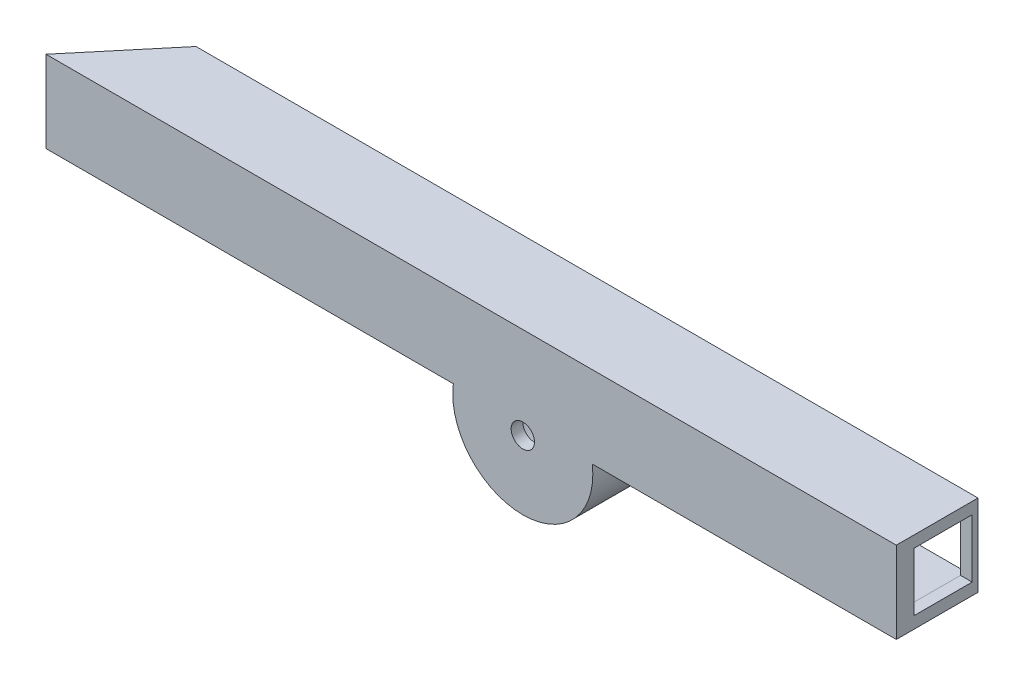
ISO-10303-21;
HEADER;
FILE_DESCRIPTION(('STEP AP214'),'2;1');
FILE_NAME('part.step','',(''),(''),'','','');
FILE_SCHEMA(('AUTOMOTIVE_DESIGN { 1 0 10303 214 1 1 1 1 }'));
ENDSEC;
DATA;
#1=APPLICATION_CONTEXT('core data for automotive mechanical design processes');
#2=APPLICATION_PROTOCOL_DEFINITION('international standard','automotive_design',2000,#1);
#3=PRODUCT_CONTEXT('',#1,'mechanical');
#4=PRODUCT('Part','Part','',(#3));
#5=PRODUCT_RELATED_PRODUCT_CATEGORY('part','',(#4));
#6=PRODUCT_DEFINITION_FORMATION('','',#4);
#7=PRODUCT_DEFINITION_CONTEXT('part definition',#1,'design');
#8=PRODUCT_DEFINITION('design','',#6,#7);
#9=PRODUCT_DEFINITION_SHAPE('','',#8);
#10=(LENGTH_UNIT() NAMED_UNIT(*) SI_UNIT(.MILLI.,.METRE.));
#11=(NAMED_UNIT(*) PLANE_ANGLE_UNIT() SI_UNIT($,.RADIAN.));
#12=(NAMED_UNIT(*) SI_UNIT($,.STERADIAN.) SOLID_ANGLE_UNIT());
#13=UNCERTAINTY_MEASURE_WITH_UNIT(LENGTH_MEASURE(1.E-05),#10,'distance_accuracy_value','');
#14=(GEOMETRIC_REPRESENTATION_CONTEXT(3) GLOBAL_UNCERTAINTY_ASSIGNED_CONTEXT((#13)) GLOBAL_UNIT_ASSIGNED_CONTEXT((#10,
#11,#12)) REPRESENTATION_CONTEXT('',''));
#15=CARTESIAN_POINT('',(0.,0.,0.));
#16=DIRECTION('',(0.,0.,1.));
#17=DIRECTION('',(1.,0.,0.));
#18=AXIS2_PLACEMENT_3D('',#15,#16,#17);
#19=CARTESIAN_POINT('',(1.5,-4.25,0.));
#20=DIRECTION('',(0.,0.,1.));
#21=DIRECTION('',(0.,-1.,0.));
#22=AXIS2_PLACEMENT_3D('',#19,#20,#21);
#23=PLANE('',#22);
#24=DIRECTION('',(0.,-1.,0.));
#25=VECTOR('',#24,1.);
#26=CARTESIAN_POINT('',(-33.5,3.5,0.));
#27=LINE('',#26,#25);
#28=CARTESIAN_POINT('',(-33.5,3.5,0.));
#29=VERTEX_POINT('',#28);
#30=CARTESIAN_POINT('',(-33.5,-3.5,0.));
#31=VERTEX_POINT('',#30);
#32=EDGE_CURVE('E11',#29,#31,#27,.T.);
#33=ORIENTED_EDGE('',*,*,#32,.F.);
#34=DIRECTION('',(-1.,0.,0.));
#35=VECTOR('',#34,1.);
#36=CARTESIAN_POINT('',(-33.5,3.5,0.));
#37=LINE('',#36,#35);
#38=CARTESIAN_POINT('',(33.5,3.5,0.));
#39=VERTEX_POINT('',#38);
#40=EDGE_CURVE('E25',#39,#29,#37,.T.);
#41=ORIENTED_EDGE('',*,*,#40,.F.);
#42=DIRECTION('',(0.,1.,0.));
#43=VECTOR('',#42,1.);
#44=CARTESIAN_POINT('',(33.5,3.5,0.));
#45=LINE('',#44,#43);
#46=CARTESIAN_POINT('',(33.5,-3.5,0.));
#47=VERTEX_POINT('',#46);
#48=EDGE_CURVE('E376',#47,#39,#45,.T.);
#49=ORIENTED_EDGE('',*,*,#48,.F.);
#50=DIRECTION('',(1.,0.,0.));
#51=VECTOR('',#50,1.);
#52=CARTESIAN_POINT('',(7.45294044989532,-3.5,0.));
#53=LINE('',#52,#51);
#54=CARTESIAN_POINT('',(7.45294044989532,-3.5,0.));
#55=VERTEX_POINT('',#54);
#56=EDGE_CURVE('E372',#55,#47,#53,.T.);
#57=ORIENTED_EDGE('',*,*,#56,.F.);
#58=CARTESIAN_POINT('',(1.5,-4.25,0.));
#59=DIRECTION('',(0.,0.,1.));
#60=DIRECTION('',(0.,-1.,0.));
#61=AXIS2_PLACEMENT_3D('',#58,#59,#60);
#62=CIRCLE('',#61,6.);
#63=CARTESIAN_POINT('',(-4.45294044989533,-3.5,0.));
#64=VERTEX_POINT('',#63);
#65=EDGE_CURVE('E368',#64,#55,#62,.T.);
#66=ORIENTED_EDGE('',*,*,#65,.F.);
#67=DIRECTION('',(1.,0.,0.));
#68=VECTOR('',#67,1.);
#69=CARTESIAN_POINT('',(-33.5,-3.5,0.));
#70=LINE('',#69,#68);
#71=EDGE_CURVE('E364',#31,#64,#70,.T.);
#72=ORIENTED_EDGE('',*,*,#71,.F.);
#73=EDGE_LOOP('',(#33,#41,#49,#57,#66,#72));
#74=FACE_BOUND('',#73,.T.);
#75=DIRECTION('',(0.,1.,0.));
#76=VECTOR('',#75,1.);
#77=CARTESIAN_POINT('',(32.5,2.5,0.));
#78=LINE('',#77,#76);
#79=CARTESIAN_POINT('',(32.5,-2.5,0.));
#80=VERTEX_POINT('',#79);
#81=CARTESIAN_POINT('',(32.5,2.5,0.));
#82=VERTEX_POINT('',#81);
#83=EDGE_CURVE('E361',#80,#82,#78,.T.);
#84=ORIENTED_EDGE('',*,*,#83,.T.);
#85=DIRECTION('',(-1.,0.,0.));
#86=VECTOR('',#85,1.);
#87=CARTESIAN_POINT('',(-32.5,2.5,0.));
#88=LINE('',#87,#86);
#89=CARTESIAN_POINT('',(-30.11,2.5,0.));
#90=VERTEX_POINT('',#89);
#91=EDGE_CURVE('E358',#82,#90,#88,.T.);
#92=ORIENTED_EDGE('',*,*,#91,.T.);
#93=DIRECTION('',(0.,1.,0.));
#94=VECTOR('',#93,1.);
#95=CARTESIAN_POINT('',(-30.11,2.5,0.));
#96=LINE('',#95,#94);
#97=CARTESIAN_POINT('',(-30.11,-2.5,0.));
#98=VERTEX_POINT('',#97);
#99=EDGE_CURVE('E354',#98,#90,#96,.T.);
#100=ORIENTED_EDGE('',*,*,#99,.F.);
#101=DIRECTION('',(1.,0.,0.));
#102=VECTOR('',#101,1.);
#103=CARTESIAN_POINT('',(-32.5,-2.5,0.));
#104=LINE('',#103,#102);
#105=CARTESIAN_POINT('',(-3.1837484987988,-2.5,0.));
#106=VERTEX_POINT('',#105);
#107=EDGE_CURVE('E351',#98,#106,#104,.T.);
#108=ORIENTED_EDGE('',*,*,#107,.T.);
#109=CARTESIAN_POINT('',(1.5,-4.25,0.));
#110=DIRECTION('',(0.,0.,1.));
#111=DIRECTION('',(0.,-1.,0.));
#112=AXIS2_PLACEMENT_3D('',#109,#110,#111);
#113=CIRCLE('',#112,5.);
#114=CARTESIAN_POINT('',(6.18374849879879,-2.5,0.));
#115=VERTEX_POINT('',#114);
#116=EDGE_CURVE('E348',#106,#115,#113,.T.);
#117=ORIENTED_EDGE('',*,*,#116,.T.);
#118=DIRECTION('',(1.,0.,0.));
#119=VECTOR('',#118,1.);
#120=CARTESIAN_POINT('',(6.18374849879879,-2.5,0.));
#121=LINE('',#120,#119);
#122=EDGE_CURVE('E345',#115,#80,#121,.T.);
#123=ORIENTED_EDGE('',*,*,#122,.T.);
#124=EDGE_LOOP('',(#84,#92,#100,#108,#117,#123));
#125=FACE_BOUND('',#124,.T.);
#126=ADVANCED_FACE('F17',(#74,#125),#23,.F.);
#127=CARTESIAN_POINT('',(-33.5,-3.5,6.));
#128=DIRECTION('',(0.,1.,0.));
#129=DIRECTION('',(-1.,0.,0.));
#130=AXIS2_PLACEMENT_3D('',#127,#128,#129);
#131=PLANE('',#130);
#132=ORIENTED_EDGE('',*,*,#71,.T.);
#133=DIRECTION('',(0.,0.,-1.));
#134=VECTOR('',#133,1.);
#135=CARTESIAN_POINT('',(-4.45294044989533,-3.5,6.));
#136=LINE('',#135,#134);
#137=CARTESIAN_POINT('',(-4.45294044989533,-3.5,7.));
#138=VERTEX_POINT('',#137);
#139=EDGE_CURVE('E341',#138,#64,#136,.T.);
#140=ORIENTED_EDGE('',*,*,#139,.F.);
#141=DIRECTION('',(1.,0.,0.));
#142=VECTOR('',#141,1.);
#143=CARTESIAN_POINT('',(-33.5,-3.5,7.));
#144=LINE('',#143,#142);
#145=CARTESIAN_POINT('',(-39.3497966743809,-3.5,7.));
#146=VERTEX_POINT('',#145);
#147=EDGE_CURVE('E337',#146,#138,#144,.T.);
#148=ORIENTED_EDGE('',*,*,#147,.F.);
#149=DIRECTION('',(0.641248850281192,0.,-0.767332986397073));
#150=VECTOR('',#149,1.);
#151=CARTESIAN_POINT('',(-39.3497966743809,-3.5,7.));
#152=LINE('',#151,#150);
#153=EDGE_CURVE('E333',#146,#31,#152,.T.);
#154=ORIENTED_EDGE('',*,*,#153,.T.);
#155=EDGE_LOOP('',(#132,#140,#148,#154));
#156=FACE_BOUND('',#155,.T.);
#157=ADVANCED_FACE('F447',(#156),#131,.F.);
#158=CARTESIAN_POINT('',(1.5,-4.25,6.));
#159=DIRECTION('',(0.,0.,-1.));
#160=DIRECTION('',(0.,1.,0.));
#161=AXIS2_PLACEMENT_3D('',#158,#159,#160);
#162=CYLINDRICAL_SURFACE('',#161,6.);
#163=ORIENTED_EDGE('',*,*,#65,.T.);
#164=DIRECTION('',(0.,0.,-1.));
#165=VECTOR('',#164,1.);
#166=CARTESIAN_POINT('',(7.45294044989532,-3.5,6.));
#167=LINE('',#166,#165);
#168=CARTESIAN_POINT('',(7.45294044989532,-3.5,7.));
#169=VERTEX_POINT('',#168);
#170=EDGE_CURVE('E329',#169,#55,#167,.T.);
#171=ORIENTED_EDGE('',*,*,#170,.F.);
#172=CARTESIAN_POINT('',(1.5,-4.25,7.));
#173=DIRECTION('',(0.,0.,1.));
#174=DIRECTION('',(0.,-1.,0.));
#175=AXIS2_PLACEMENT_3D('',#172,#173,#174);
#176=CIRCLE('',#175,6.);
#177=EDGE_CURVE('E325',#138,#169,#176,.T.);
#178=ORIENTED_EDGE('',*,*,#177,.F.);
#179=ORIENTED_EDGE('',*,*,#139,.T.);
#180=EDGE_LOOP('',(#163,#171,#178,#179));
#181=FACE_BOUND('',#180,.T.);
#182=ADVANCED_FACE('F451',(#181),#162,.T.);
#183=CARTESIAN_POINT('',(7.45294044989532,-3.5,6.));
#184=DIRECTION('',(0.,1.,0.));
#185=DIRECTION('',(-1.,0.,0.));
#186=AXIS2_PLACEMENT_3D('',#183,#184,#185);
#187=PLANE('',#186);
#188=ORIENTED_EDGE('',*,*,#56,.T.);
#189=DIRECTION('',(0.,0.,-1.));
#190=VECTOR('',#189,1.);
#191=CARTESIAN_POINT('',(33.5,-3.5,6.));
#192=LINE('',#191,#190);
#193=CARTESIAN_POINT('',(33.5,-3.5,7.));
#194=VERTEX_POINT('',#193);
#195=EDGE_CURVE('E321',#194,#47,#192,.T.);
#196=ORIENTED_EDGE('',*,*,#195,.F.);
#197=DIRECTION('',(1.,0.,0.));
#198=VECTOR('',#197,1.);
#199=CARTESIAN_POINT('',(33.5,-3.5,7.));
#200=LINE('',#199,#198);
#201=EDGE_CURVE('E317',#169,#194,#200,.T.);
#202=ORIENTED_EDGE('',*,*,#201,.F.);
#203=ORIENTED_EDGE('',*,*,#170,.T.);
#204=EDGE_LOOP('',(#188,#196,#202,#203));
#205=FACE_BOUND('',#204,.T.);
#206=ADVANCED_FACE('F456',(#205),#187,.F.);
#207=CARTESIAN_POINT('',(33.5,3.5,6.));
#208=DIRECTION('',(-1.,0.,0.));
#209=DIRECTION('',(0.,-1.,0.));
#210=AXIS2_PLACEMENT_3D('',#207,#208,#209);
#211=PLANE('',#210);
#212=DIRECTION('',(0.,1.,0.));
#213=VECTOR('',#212,1.);
#214=CARTESIAN_POINT('',(33.5,2.51095836018431,0.5));
#215=LINE('',#214,#213);
#216=CARTESIAN_POINT('',(33.5,-2.48904163981569,0.5));
#217=VERTEX_POINT('',#216);
#218=CARTESIAN_POINT('',(33.5,2.51095836018431,0.5));
#219=VERTEX_POINT('',#218);
#220=EDGE_CURVE('E199',#217,#219,#215,.T.);
#221=ORIENTED_EDGE('',*,*,#220,.F.);
#222=DIRECTION('',(0.,0.,-1.));
#223=VECTOR('',#222,1.);
#224=CARTESIAN_POINT('',(33.5,-2.48904163981569,5.5));
#225=LINE('',#224,#223);
#226=CARTESIAN_POINT('',(33.5,-2.48904163981569,5.5));
#227=VERTEX_POINT('',#226);
#228=EDGE_CURVE('E311',#227,#217,#225,.T.);
#229=ORIENTED_EDGE('',*,*,#228,.F.);
#230=DIRECTION('',(0.,-1.,0.));
#231=VECTOR('',#230,1.);
#232=CARTESIAN_POINT('',(33.5,2.51095836018431,5.5));
#233=LINE('',#232,#231);
#234=CARTESIAN_POINT('',(33.5,2.51095836018431,5.5));
#235=VERTEX_POINT('',#234);
#236=EDGE_CURVE('E307',#235,#227,#233,.T.);
#237=ORIENTED_EDGE('',*,*,#236,.F.);
#238=DIRECTION('',(0.,0.,1.));
#239=VECTOR('',#238,1.);
#240=CARTESIAN_POINT('',(33.5,2.51095836018431,5.5));
#241=LINE('',#240,#239);
#242=EDGE_CURVE('E304',#219,#235,#241,.T.);
#243=ORIENTED_EDGE('',*,*,#242,.F.);
#244=EDGE_LOOP('',(#221,#229,#237,#243));
#245=FACE_BOUND('',#244,.T.);
#246=ORIENTED_EDGE('',*,*,#48,.T.);
#247=DIRECTION('',(0.,0.,-1.));
#248=VECTOR('',#247,1.);
#249=CARTESIAN_POINT('',(33.5,3.5,6.));
#250=LINE('',#249,#248);
#251=CARTESIAN_POINT('',(33.5,3.5,7.));
#252=VERTEX_POINT('',#251);
#253=EDGE_CURVE('E300',#252,#39,#250,.T.);
#254=ORIENTED_EDGE('',*,*,#253,.F.);
#255=DIRECTION('',(0.,1.,0.));
#256=VECTOR('',#255,1.);
#257=CARTESIAN_POINT('',(33.5,3.5,7.));
#258=LINE('',#257,#256);
#259=EDGE_CURVE('E296',#194,#252,#258,.T.);
#260=ORIENTED_EDGE('',*,*,#259,.F.);
#261=ORIENTED_EDGE('',*,*,#195,.T.);
#262=EDGE_LOOP('',(#246,#254,#260,#261));
#263=FACE_BOUND('',#262,.T.);
#264=ADVANCED_FACE('F462',(#245,#263),#211,.F.);
#265=CARTESIAN_POINT('',(-33.5,3.5,6.));
#266=DIRECTION('',(0.,-1.,0.));
#267=DIRECTION('',(1.,0.,0.));
#268=AXIS2_PLACEMENT_3D('',#265,#266,#267);
#269=PLANE('',#268);
#270=ORIENTED_EDGE('',*,*,#40,.T.);
#271=DIRECTION('',(-0.641248850281192,0.,0.767332986397073));
#272=VECTOR('',#271,1.);
#273=CARTESIAN_POINT('',(-39.3497966743809,3.5,7.));
#274=LINE('',#273,#272);
#275=CARTESIAN_POINT('',(-39.3497966743809,3.5,7.));
#276=VERTEX_POINT('',#275);
#277=EDGE_CURVE('E293',#29,#276,#274,.T.);
#278=ORIENTED_EDGE('',*,*,#277,.T.);
#279=DIRECTION('',(-1.,0.,0.));
#280=VECTOR('',#279,1.);
#281=CARTESIAN_POINT('',(-33.5,3.5,7.));
#282=LINE('',#281,#280);
#283=EDGE_CURVE('E289',#252,#276,#282,.T.);
#284=ORIENTED_EDGE('',*,*,#283,.F.);
#285=ORIENTED_EDGE('',*,*,#253,.T.);
#286=EDGE_LOOP('',(#270,#278,#284,#285));
#287=FACE_BOUND('',#286,.T.);
#288=ADVANCED_FACE('F382',(#287),#269,.F.);
#289=CARTESIAN_POINT('',(32.5,2.5,6.));
#290=DIRECTION('',(-1.,0.,0.));
#291=DIRECTION('',(0.,-1.,0.));
#292=AXIS2_PLACEMENT_3D('',#289,#290,#291);
#293=PLANE('',#292);
#294=DIRECTION('',(0.,1.,0.));
#295=VECTOR('',#294,1.);
#296=CARTESIAN_POINT('',(32.5,2.5,5.5));
#297=LINE('',#296,#295);
#298=CARTESIAN_POINT('',(32.5,-2.48904163981569,5.5));
#299=VERTEX_POINT('',#298);
#300=CARTESIAN_POINT('',(32.5,2.5,5.5));
#301=VERTEX_POINT('',#300);
#302=EDGE_CURVE('E285',#299,#301,#297,.T.);
#303=ORIENTED_EDGE('',*,*,#302,.F.);
#304=DIRECTION('',(0.,0.,1.));
#305=VECTOR('',#304,1.);
#306=CARTESIAN_POINT('',(32.5,-2.48904163981569,6.));
#307=LINE('',#306,#305);
#308=CARTESIAN_POINT('',(32.5,-2.48904163981569,0.5));
#309=VERTEX_POINT('',#308);
#310=EDGE_CURVE('E281',#309,#299,#307,.T.);
#311=ORIENTED_EDGE('',*,*,#310,.F.);
#312=DIRECTION('',(0.,-1.,0.));
#313=VECTOR('',#312,1.);
#314=CARTESIAN_POINT('',(32.5,2.5,0.5));
#315=LINE('',#314,#313);
#316=CARTESIAN_POINT('',(32.5,2.5,0.5));
#317=VERTEX_POINT('',#316);
#318=EDGE_CURVE('E278',#317,#309,#315,.T.);
#319=ORIENTED_EDGE('',*,*,#318,.F.);
#320=DIRECTION('',(0.,0.,-1.));
#321=VECTOR('',#320,1.);
#322=CARTESIAN_POINT('',(32.5,2.5,6.));
#323=LINE('',#322,#321);
#324=EDGE_CURVE('E274',#317,#82,#323,.T.);
#325=ORIENTED_EDGE('',*,*,#324,.T.);
#326=ORIENTED_EDGE('',*,*,#83,.F.);
#327=DIRECTION('',(0.,0.,-1.));
#328=VECTOR('',#327,1.);
#329=CARTESIAN_POINT('',(32.5,-2.5,6.));
#330=LINE('',#329,#328);
#331=CARTESIAN_POINT('',(32.5,-2.5,6.));
#332=VERTEX_POINT('',#331);
#333=EDGE_CURVE('E270',#332,#80,#330,.T.);
#334=ORIENTED_EDGE('',*,*,#333,.F.);
#335=DIRECTION('',(0.,1.,0.));
#336=VECTOR('',#335,1.);
#337=CARTESIAN_POINT('',(32.5,2.5,6.));
#338=LINE('',#337,#336);
#339=CARTESIAN_POINT('',(32.5,2.5,6.));
#340=VERTEX_POINT('',#339);
#341=EDGE_CURVE('E267',#332,#340,#338,.T.);
#342=ORIENTED_EDGE('',*,*,#341,.T.);
#343=DIRECTION('',(0.,0.,-1.));
#344=VECTOR('',#343,1.);
#345=CARTESIAN_POINT('',(32.5,2.5,6.));
#346=LINE('',#345,#344);
#347=EDGE_CURVE('E264',#340,#301,#346,.T.);
#348=ORIENTED_EDGE('',*,*,#347,.T.);
#349=EDGE_LOOP('',(#303,#311,#319,#325,#326,#334,#342,#348));
#350=FACE_BOUND('',#349,.T.);
#351=ADVANCED_FACE('F431',(#350),#293,.T.);
#352=CARTESIAN_POINT('',(-32.5,2.5,6.));
#353=DIRECTION('',(0.,-1.,0.));
#354=DIRECTION('',(1.,0.,0.));
#355=AXIS2_PLACEMENT_3D('',#352,#353,#354);
#356=PLANE('',#355);
#357=DIRECTION('',(0.,0.,1.));
#358=VECTOR('',#357,1.);
#359=CARTESIAN_POINT('',(-30.11,2.5,0.));
#360=LINE('',#359,#358);
#361=CARTESIAN_POINT('',(-30.11,2.5,6.));
#362=VERTEX_POINT('',#361);
#363=EDGE_CURVE('E260',#90,#362,#360,.T.);
#364=ORIENTED_EDGE('',*,*,#363,.F.);
#365=ORIENTED_EDGE('',*,*,#91,.F.);
#366=ORIENTED_EDGE('',*,*,#324,.F.);
#367=DIRECTION('',(1.,0.,0.));
#368=VECTOR('',#367,1.);
#369=CARTESIAN_POINT('',(-32.5,2.5,0.5));
#370=LINE('',#369,#368);
#371=CARTESIAN_POINT('',(27.5,2.5,0.5));
#372=VERTEX_POINT('',#371);
#373=EDGE_CURVE('E257',#372,#317,#370,.T.);
#374=ORIENTED_EDGE('',*,*,#373,.F.);
#375=DIRECTION('',(0.,0.,-1.));
#376=VECTOR('',#375,1.);
#377=CARTESIAN_POINT('',(27.5,2.5,6.));
#378=LINE('',#377,#376);
#379=CARTESIAN_POINT('',(27.5,2.5,5.5));
#380=VERTEX_POINT('',#379);
#381=EDGE_CURVE('E203',#380,#372,#378,.T.);
#382=ORIENTED_EDGE('',*,*,#381,.F.);
#383=DIRECTION('',(-1.,0.,0.));
#384=VECTOR('',#383,1.);
#385=CARTESIAN_POINT('',(-32.5,2.5,5.5));
#386=LINE('',#385,#384);
#387=EDGE_CURVE('E251',#301,#380,#386,.T.);
#388=ORIENTED_EDGE('',*,*,#387,.F.);
#389=ORIENTED_EDGE('',*,*,#347,.F.);
#390=DIRECTION('',(-1.,0.,0.));
#391=VECTOR('',#390,1.);
#392=CARTESIAN_POINT('',(-32.5,2.5,6.));
#393=LINE('',#392,#391);
#394=EDGE_CURVE('E248',#340,#362,#393,.T.);
#395=ORIENTED_EDGE('',*,*,#394,.T.);
#396=EDGE_LOOP('',(#364,#365,#366,#374,#382,#388,#389,#395));
#397=FACE_BOUND('',#396,.T.);
#398=ADVANCED_FACE('F427',(#397),#356,.T.);
#399=CARTESIAN_POINT('',(-32.5,-2.5,6.));
#400=DIRECTION('',(0.,1.,0.));
#401=DIRECTION('',(-1.,0.,0.));
#402=AXIS2_PLACEMENT_3D('',#399,#400,#401);
#403=PLANE('',#402);
#404=DIRECTION('',(0.,0.,-1.));
#405=VECTOR('',#404,1.);
#406=CARTESIAN_POINT('',(-30.11,-2.5,0.));
#407=LINE('',#406,#405);
#408=CARTESIAN_POINT('',(-30.11,-2.5,6.));
#409=VERTEX_POINT('',#408);
#410=EDGE_CURVE('E244',#409,#98,#407,.T.);
#411=ORIENTED_EDGE('',*,*,#410,.F.);
#412=DIRECTION('',(1.,0.,0.));
#413=VECTOR('',#412,1.);
#414=CARTESIAN_POINT('',(-32.5,-2.5,6.));
#415=LINE('',#414,#413);
#416=CARTESIAN_POINT('',(-3.1837484987988,-2.5,6.));
#417=VERTEX_POINT('',#416);
#418=EDGE_CURVE('E241',#409,#417,#415,.T.);
#419=ORIENTED_EDGE('',*,*,#418,.T.);
#420=DIRECTION('',(0.,0.,-1.));
#421=VECTOR('',#420,1.);
#422=CARTESIAN_POINT('',(-3.1837484987988,-2.5,6.));
#423=LINE('',#422,#421);
#424=EDGE_CURVE('E237',#417,#106,#423,.T.);
#425=ORIENTED_EDGE('',*,*,#424,.T.);
#426=ORIENTED_EDGE('',*,*,#107,.F.);
#427=EDGE_LOOP('',(#411,#419,#425,#426));
#428=FACE_BOUND('',#427,.T.);
#429=ADVANCED_FACE('F415',(#428),#403,.T.);
#430=CARTESIAN_POINT('',(1.5,-4.25,6.));
#431=DIRECTION('',(0.,0.,-1.));
#432=DIRECTION('',(0.,1.,0.));
#433=AXIS2_PLACEMENT_3D('',#430,#431,#432);
#434=CYLINDRICAL_SURFACE('',#433,5.);
#435=ORIENTED_EDGE('',*,*,#116,.F.);
#436=ORIENTED_EDGE('',*,*,#424,.F.);
#437=CARTESIAN_POINT('',(1.5,-4.25,6.));
#438=DIRECTION('',(0.,0.,1.));
#439=DIRECTION('',(0.,-1.,0.));
#440=AXIS2_PLACEMENT_3D('',#437,#438,#439);
#441=CIRCLE('',#440,5.);
#442=CARTESIAN_POINT('',(6.18374849879879,-2.5,6.));
#443=VERTEX_POINT('',#442);
#444=EDGE_CURVE('E234',#417,#443,#441,.T.);
#445=ORIENTED_EDGE('',*,*,#444,.T.);
#446=DIRECTION('',(0.,0.,-1.));
#447=VECTOR('',#446,1.);
#448=CARTESIAN_POINT('',(6.18374849879879,-2.5,6.));
#449=LINE('',#448,#447);
#450=EDGE_CURVE('E230',#443,#115,#449,.T.);
#451=ORIENTED_EDGE('',*,*,#450,.T.);
#452=EDGE_LOOP('',(#435,#436,#445,#451));
#453=FACE_BOUND('',#452,.T.);
#454=ADVANCED_FACE('F419',(#453),#434,.F.);
#455=CARTESIAN_POINT('',(6.18374849879879,-2.5,6.));
#456=DIRECTION('',(0.,1.,0.));
#457=DIRECTION('',(-1.,0.,0.));
#458=AXIS2_PLACEMENT_3D('',#455,#456,#457);
#459=PLANE('',#458);
#460=ORIENTED_EDGE('',*,*,#122,.F.);
#461=ORIENTED_EDGE('',*,*,#450,.F.);
#462=DIRECTION('',(1.,0.,0.));
#463=VECTOR('',#462,1.);
#464=CARTESIAN_POINT('',(6.18374849879879,-2.5,6.));
#465=LINE('',#464,#463);
#466=EDGE_CURVE('E226',#443,#332,#465,.T.);
#467=ORIENTED_EDGE('',*,*,#466,.T.);
#468=ORIENTED_EDGE('',*,*,#333,.T.);
#469=EDGE_LOOP('',(#460,#461,#467,#468));
#470=FACE_BOUND('',#469,.T.);
#471=ADVANCED_FACE('F433',(#470),#459,.T.);
#472=CARTESIAN_POINT('',(27.5,-2.48904163981568,5.5));
#473=DIRECTION('',(0.,-1.,0.));
#474=DIRECTION('',(1.,0.,0.));
#475=AXIS2_PLACEMENT_3D('',#472,#473,#474);
#476=PLANE('',#475);
#477=ORIENTED_EDGE('',*,*,#310,.T.);
#478=DIRECTION('',(1.,0.,0.));
#479=VECTOR('',#478,1.);
#480=CARTESIAN_POINT('',(27.5,-2.48904163981568,5.5));
#481=LINE('',#480,#479);
#482=EDGE_CURVE('E222',#299,#227,#481,.T.);
#483=ORIENTED_EDGE('',*,*,#482,.T.);
#484=ORIENTED_EDGE('',*,*,#228,.T.);
#485=DIRECTION('',(1.,0.,0.));
#486=VECTOR('',#485,1.);
#487=CARTESIAN_POINT('',(27.5,-2.48904163981568,0.5));
#488=LINE('',#487,#486);
#489=EDGE_CURVE('E219',#309,#217,#488,.T.);
#490=ORIENTED_EDGE('',*,*,#489,.F.);
#491=EDGE_LOOP('',(#477,#483,#484,#490));
#492=FACE_BOUND('',#491,.T.);
#493=ADVANCED_FACE('F435',(#492),#476,.F.);
#494=CARTESIAN_POINT('',(27.5,2.51095836018432,5.5));
#495=DIRECTION('',(0.,0.,1.));
#496=DIRECTION('',(0.,-1.,0.));
#497=AXIS2_PLACEMENT_3D('',#494,#495,#496);
#498=PLANE('',#497);
#499=ORIENTED_EDGE('',*,*,#302,.T.);
#500=ORIENTED_EDGE('',*,*,#387,.T.);
#501=DIRECTION('',(0.,-1.,0.));
#502=VECTOR('',#501,1.);
#503=CARTESIAN_POINT('',(27.5,2.51095836018432,5.5));
#504=LINE('',#503,#502);
#505=CARTESIAN_POINT('',(27.5,2.51095836018432,5.5));
#506=VERTEX_POINT('',#505);
#507=EDGE_CURVE('E216',#506,#380,#504,.T.);
#508=ORIENTED_EDGE('',*,*,#507,.F.);
#509=DIRECTION('',(1.,0.,0.));
#510=VECTOR('',#509,1.);
#511=CARTESIAN_POINT('',(27.5,2.51095836018432,5.5));
#512=LINE('',#511,#510);
#513=EDGE_CURVE('E185',#506,#235,#512,.T.);
#514=ORIENTED_EDGE('',*,*,#513,.T.);
#515=ORIENTED_EDGE('',*,*,#236,.T.);
#516=ORIENTED_EDGE('',*,*,#482,.F.);
#517=EDGE_LOOP('',(#499,#500,#508,#514,#515,#516));
#518=FACE_BOUND('',#517,.T.);
#519=ADVANCED_FACE('F442',(#518),#498,.F.);
#520=CARTESIAN_POINT('',(27.5,2.51095836018432,5.5));
#521=DIRECTION('',(0.,1.,0.));
#522=DIRECTION('',(-1.,0.,0.));
#523=AXIS2_PLACEMENT_3D('',#520,#521,#522);
#524=PLANE('',#523);
#525=ORIENTED_EDGE('',*,*,#242,.T.);
#526=ORIENTED_EDGE('',*,*,#513,.F.);
#527=DIRECTION('',(0.,0.,1.));
#528=VECTOR('',#527,1.);
#529=CARTESIAN_POINT('',(27.5,2.51095836018432,5.5));
#530=LINE('',#529,#528);
#531=CARTESIAN_POINT('',(27.5,2.51095836018432,0.5));
#532=VERTEX_POINT('',#531);
#533=EDGE_CURVE('E178',#532,#506,#530,.T.);
#534=ORIENTED_EDGE('',*,*,#533,.F.);
#535=DIRECTION('',(1.,0.,0.));
#536=VECTOR('',#535,1.);
#537=CARTESIAN_POINT('',(27.5,2.51095836018432,0.5));
#538=LINE('',#537,#536);
#539=EDGE_CURVE('E182',#532,#219,#538,.T.);
#540=ORIENTED_EDGE('',*,*,#539,.T.);
#541=EDGE_LOOP('',(#525,#526,#534,#540));
#542=FACE_BOUND('',#541,.T.);
#543=ADVANCED_FACE('F181',(#542),#524,.F.);
#544=CARTESIAN_POINT('',(27.5,2.51095836018432,0.5));
#545=DIRECTION('',(0.,0.,-1.));
#546=DIRECTION('',(0.,1.,0.));
#547=AXIS2_PLACEMENT_3D('',#544,#545,#546);
#548=PLANE('',#547);
#549=ORIENTED_EDGE('',*,*,#318,.T.);
#550=ORIENTED_EDGE('',*,*,#489,.T.);
#551=ORIENTED_EDGE('',*,*,#220,.T.);
#552=ORIENTED_EDGE('',*,*,#539,.F.);
#553=DIRECTION('',(0.,1.,0.));
#554=VECTOR('',#553,1.);
#555=CARTESIAN_POINT('',(27.5,2.51095836018432,0.5));
#556=LINE('',#555,#554);
#557=EDGE_CURVE('E196',#372,#532,#556,.T.);
#558=ORIENTED_EDGE('',*,*,#557,.F.);
#559=ORIENTED_EDGE('',*,*,#373,.T.);
#560=EDGE_LOOP('',(#549,#550,#551,#552,#558,#559));
#561=FACE_BOUND('',#560,.T.);
#562=ADVANCED_FACE('F194',(#561),#548,.F.);
#563=CARTESIAN_POINT('',(27.5,0.,0.));
#564=DIRECTION('',(-1.,0.,0.));
#565=DIRECTION('',(0.,-1.,0.));
#566=AXIS2_PLACEMENT_3D('',#563,#564,#565);
#567=PLANE('',#566);
#568=ORIENTED_EDGE('',*,*,#381,.T.);
#569=ORIENTED_EDGE('',*,*,#557,.T.);
#570=ORIENTED_EDGE('',*,*,#533,.T.);
#571=ORIENTED_EDGE('',*,*,#507,.T.);
#572=EDGE_LOOP('',(#568,#569,#570,#571));
#573=FACE_BOUND('',#572,.T.);
#574=ADVANCED_FACE('F202',(#573),#567,.F.);
#575=CARTESIAN_POINT('',(1.5,-4.25,6.));
#576=DIRECTION('',(0.,0.,1.));
#577=DIRECTION('',(0.,-1.,0.));
#578=AXIS2_PLACEMENT_3D('',#575,#576,#577);
#579=PLANE('',#578);
#580=CARTESIAN_POINT('',(1.5,-4.36156196701798,6.));
#581=DIRECTION('',(0.,0.,-1.));
#582=DIRECTION('',(0.,1.,0.));
#583=AXIS2_PLACEMENT_3D('',#580,#581,#582);
#584=CIRCLE('',#583,1.);
#585=CARTESIAN_POINT('',(1.5,-3.36156196701798,6.));
#586=VERTEX_POINT('',#585);
#587=EDGE_CURVE('E205',#586,#586,#584,.T.);
#588=ORIENTED_EDGE('',*,*,#587,.F.);
#589=EDGE_LOOP('',(#588));
#590=FACE_BOUND('',#589,.T.);
#591=ORIENTED_EDGE('',*,*,#418,.F.);
#592=DIRECTION('',(0.,-1.,0.));
#593=VECTOR('',#592,1.);
#594=CARTESIAN_POINT('',(-30.11,2.5,6.));
#595=LINE('',#594,#593);
#596=EDGE_CURVE('E210',#362,#409,#595,.T.);
#597=ORIENTED_EDGE('',*,*,#596,.F.);
#598=ORIENTED_EDGE('',*,*,#394,.F.);
#599=ORIENTED_EDGE('',*,*,#341,.F.);
#600=ORIENTED_EDGE('',*,*,#466,.F.);
#601=ORIENTED_EDGE('',*,*,#444,.F.);
#602=EDGE_LOOP('',(#591,#597,#598,#599,#600,#601));
#603=FACE_BOUND('',#602,.T.);
#604=ADVANCED_FACE('F409',(#590,#603),#579,.F.);
#605=CARTESIAN_POINT('',(1.5,-4.25,7.));
#606=DIRECTION('',(0.,0.,1.));
#607=DIRECTION('',(0.,-1.,0.));
#608=AXIS2_PLACEMENT_3D('',#605,#606,#607);
#609=PLANE('',#608);
#610=CARTESIAN_POINT('',(1.5,-4.36156196701798,7.));
#611=DIRECTION('',(0.,0.,1.));
#612=DIRECTION('',(0.,-1.,0.));
#613=AXIS2_PLACEMENT_3D('',#610,#611,#612);
#614=CIRCLE('',#613,1.);
#615=CARTESIAN_POINT('',(1.5,-5.36156196701798,7.));
#616=VERTEX_POINT('',#615);
#617=EDGE_CURVE('E392',#616,#616,#614,.T.);
#618=ORIENTED_EDGE('',*,*,#617,.F.);
#619=EDGE_LOOP('',(#618));
#620=FACE_BOUND('',#619,.T.);
#621=ORIENTED_EDGE('',*,*,#283,.T.);
#622=DIRECTION('',(0.,-1.,0.));
#623=VECTOR('',#622,1.);
#624=CARTESIAN_POINT('',(-39.3497966743809,12.622506296605,7.));
#625=LINE('',#624,#623);
#626=EDGE_CURVE('E389',#276,#146,#625,.T.);
#627=ORIENTED_EDGE('',*,*,#626,.T.);
#628=ORIENTED_EDGE('',*,*,#147,.T.);
#629=ORIENTED_EDGE('',*,*,#177,.T.);
#630=ORIENTED_EDGE('',*,*,#201,.T.);
#631=ORIENTED_EDGE('',*,*,#259,.T.);
#632=EDGE_LOOP('',(#621,#627,#628,#629,#630,#631));
#633=FACE_BOUND('',#632,.T.);
#634=ADVANCED_FACE('F546',(#620,#633),#609,.T.);
#635=CARTESIAN_POINT('',(1.5,-4.36156196701798,16.));
#636=DIRECTION('',(0.,0.,-1.));
#637=DIRECTION('',(0.,1.,0.));
#638=AXIS2_PLACEMENT_3D('',#635,#636,#637);
#639=CYLINDRICAL_SURFACE('',#638,1.);
#640=ORIENTED_EDGE('',*,*,#617,.T.);
#641=EDGE_LOOP('',(#640));
#642=FACE_BOUND('',#641,.T.);
#643=ORIENTED_EDGE('',*,*,#587,.T.);
#644=EDGE_LOOP('',(#643));
#645=FACE_BOUND('',#644,.T.);
#646=ADVANCED_FACE('F557',(#642,#645),#639,.F.);
#647=CARTESIAN_POINT('',(-30.11,0.,0.));
#648=DIRECTION('',(1.,0.,0.));
#649=DIRECTION('',(0.,1.,0.));
#650=AXIS2_PLACEMENT_3D('',#647,#648,#649);
#651=PLANE('',#650);
#652=ORIENTED_EDGE('',*,*,#363,.T.);
#653=ORIENTED_EDGE('',*,*,#596,.T.);
#654=ORIENTED_EDGE('',*,*,#410,.T.);
#655=ORIENTED_EDGE('',*,*,#99,.T.);
#656=EDGE_LOOP('',(#652,#653,#654,#655));
#657=FACE_BOUND('',#656,.T.);
#658=ADVANCED_FACE('F404',(#657),#651,.T.);
#659=CARTESIAN_POINT('',(-39.3497966743809,12.622506296605,7.));
#660=DIRECTION('',(-0.767332986397073,0.,-0.641248850281192));
#661=DIRECTION('',(0.641248850281192,0.,-0.767332986397073));
#662=AXIS2_PLACEMENT_3D('',#659,#660,#661);
#663=PLANE('',#662);
#664=ORIENTED_EDGE('',*,*,#277,.F.);
#665=ORIENTED_EDGE('',*,*,#32,.T.);
#666=ORIENTED_EDGE('',*,*,#153,.F.);
#667=ORIENTED_EDGE('',*,*,#626,.F.);
#668=EDGE_LOOP('',(#664,#665,#666,#667));
#669=FACE_BOUND('',#668,.T.);
#670=ADVANCED_FACE('F386',(#669),#663,.T.);
#671=CLOSED_SHELL('',(#126,#157,#182,#206,#264,#288,#351,#398,#429,#454,#471,#493,#519,#543,
#562,#574,#604,#634,#646,#658,#670));
#672=MANIFOLD_SOLID_BREP('B1',#671);
#673=ADVANCED_BREP_SHAPE_REPRESENTATION('',(#18,#672),#14);
#674=SHAPE_DEFINITION_REPRESENTATION(#9,#673);
ENDSEC;
END-ISO-10303-21;
